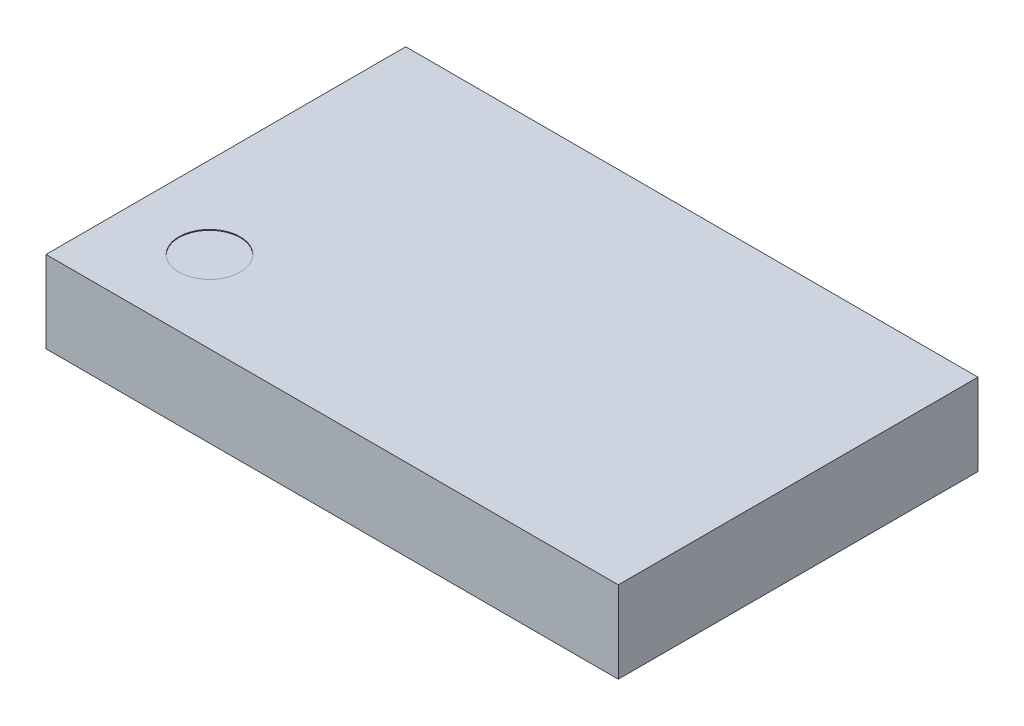
ISO-10303-21;
HEADER;
FILE_DESCRIPTION(('STEP AP214'),'2;1');
FILE_NAME('part.step','',(''),(''),'','','');
FILE_SCHEMA(('AUTOMOTIVE_DESIGN { 1 0 10303 214 1 1 1 1 }'));
ENDSEC;
DATA;
#1=APPLICATION_CONTEXT('core data for automotive mechanical design processes');
#2=APPLICATION_PROTOCOL_DEFINITION('international standard','automotive_design',2000,#1);
#3=PRODUCT_CONTEXT('',#1,'mechanical');
#4=PRODUCT('Part','Part','',(#3));
#5=PRODUCT_RELATED_PRODUCT_CATEGORY('part','',(#4));
#6=PRODUCT_DEFINITION_FORMATION('','',#4);
#7=PRODUCT_DEFINITION_CONTEXT('part definition',#1,'design');
#8=PRODUCT_DEFINITION('design','',#6,#7);
#9=PRODUCT_DEFINITION_SHAPE('','',#8);
#10=(LENGTH_UNIT() NAMED_UNIT(*) SI_UNIT(.MILLI.,.METRE.));
#11=(NAMED_UNIT(*) PLANE_ANGLE_UNIT() SI_UNIT($,.RADIAN.));
#12=(NAMED_UNIT(*) SI_UNIT($,.STERADIAN.) SOLID_ANGLE_UNIT());
#13=UNCERTAINTY_MEASURE_WITH_UNIT(LENGTH_MEASURE(1.E-05),#10,'distance_accuracy_value','');
#14=(GEOMETRIC_REPRESENTATION_CONTEXT(3) GLOBAL_UNCERTAINTY_ASSIGNED_CONTEXT((#13)) GLOBAL_UNIT_ASSIGNED_CONTEXT((#10,
#11,#12)) REPRESENTATION_CONTEXT('',''));
#15=CARTESIAN_POINT('',(0.,0.,0.));
#16=DIRECTION('',(0.,0.,1.));
#17=DIRECTION('',(1.,0.,0.));
#18=AXIS2_PLACEMENT_3D('',#15,#16,#17);
#19=CARTESIAN_POINT('',(-2.5,0.99,2.7));
#20=DIRECTION('',(0.,1.,0.));
#21=DIRECTION('',(0.,0.,1.));
#22=AXIS2_PLACEMENT_3D('',#19,#20,#21);
#23=CYLINDRICAL_SURFACE('',#22,0.375);
#24=CARTESIAN_POINT('',(-2.5,0.99,2.7));
#25=DIRECTION('',(0.,1.,0.));
#26=DIRECTION('',(0.,0.,1.));
#27=AXIS2_PLACEMENT_3D('',#24,#25,#26);
#28=CIRCLE('',#27,0.375);
#29=CARTESIAN_POINT('',(-2.5,0.99,2.325));
#30=VERTEX_POINT('',#29);
#31=CARTESIAN_POINT('',(-2.5,0.99,3.075));
#32=VERTEX_POINT('',#31);
#33=EDGE_CURVE('E10',#30,#32,#28,.T.);
#34=ORIENTED_EDGE('',*,*,#33,.F.);
#35=DIRECTION('',(0.,1.,0.));
#36=VECTOR('',#35,1.);
#37=CARTESIAN_POINT('',(-2.5,0.99,2.325));
#38=LINE('',#37,#36);
#39=CARTESIAN_POINT('',(-2.5,1.,2.325));
#40=VERTEX_POINT('',#39);
#41=EDGE_CURVE('E23',#30,#40,#38,.T.);
#42=ORIENTED_EDGE('',*,*,#41,.T.);
#43=CARTESIAN_POINT('',(-2.5,1.,2.7));
#44=DIRECTION('',(0.,1.,0.));
#45=DIRECTION('',(0.,0.,1.));
#46=AXIS2_PLACEMENT_3D('',#43,#44,#45);
#47=CIRCLE('',#46,0.375);
#48=CARTESIAN_POINT('',(-2.5,1.,3.075));
#49=VERTEX_POINT('',#48);
#50=EDGE_CURVE('E116',#40,#49,#47,.T.);
#51=ORIENTED_EDGE('',*,*,#50,.T.);
#52=DIRECTION('',(0.,1.,0.));
#53=VECTOR('',#52,1.);
#54=CARTESIAN_POINT('',(-2.5,0.99,3.075));
#55=LINE('',#54,#53);
#56=EDGE_CURVE('E36',#32,#49,#55,.T.);
#57=ORIENTED_EDGE('',*,*,#56,.F.);
#58=EDGE_LOOP('',(#34,#42,#51,#57));
#59=FACE_BOUND('',#58,.T.);
#60=ADVANCED_FACE('F16',(#59),#23,.F.);
#61=CARTESIAN_POINT('',(0.,1.,3.7));
#62=DIRECTION('',(0.,0.,-1.));
#63=DIRECTION('',(-1.,0.,0.));
#64=AXIS2_PLACEMENT_3D('',#61,#62,#63);
#65=PLANE('',#64);
#66=DIRECTION('',(1.,0.,0.));
#67=VECTOR('',#66,1.);
#68=CARTESIAN_POINT('',(0.,0.,3.7));
#69=LINE('',#68,#67);
#70=CARTESIAN_POINT('',(-3.5,0.,3.7));
#71=VERTEX_POINT('',#70);
#72=CARTESIAN_POINT('',(3.5,0.,3.7));
#73=VERTEX_POINT('',#72);
#74=EDGE_CURVE('E113',#71,#73,#69,.T.);
#75=ORIENTED_EDGE('',*,*,#74,.T.);
#76=DIRECTION('',(0.,-1.,0.));
#77=VECTOR('',#76,1.);
#78=CARTESIAN_POINT('',(3.5,1.,3.7));
#79=LINE('',#78,#77);
#80=CARTESIAN_POINT('',(3.5,1.,3.7));
#81=VERTEX_POINT('',#80);
#82=EDGE_CURVE('E110',#81,#73,#79,.T.);
#83=ORIENTED_EDGE('',*,*,#82,.F.);
#84=DIRECTION('',(1.,0.,0.));
#85=VECTOR('',#84,1.);
#86=CARTESIAN_POINT('',(0.,1.,3.7));
#87=LINE('',#86,#85);
#88=CARTESIAN_POINT('',(-3.5,1.,3.7));
#89=VERTEX_POINT('',#88);
#90=EDGE_CURVE('E108',#89,#81,#87,.T.);
#91=ORIENTED_EDGE('',*,*,#90,.F.);
#92=DIRECTION('',(0.,-1.,0.));
#93=VECTOR('',#92,1.);
#94=CARTESIAN_POINT('',(-3.5,1.,3.7));
#95=LINE('',#94,#93);
#96=EDGE_CURVE('E93',#89,#71,#95,.T.);
#97=ORIENTED_EDGE('',*,*,#96,.T.);
#98=EDGE_LOOP('',(#75,#83,#91,#97));
#99=FACE_BOUND('',#98,.T.);
#100=ADVANCED_FACE('F133',(#99),#65,.F.);
#101=CARTESIAN_POINT('',(3.5,1.,0.));
#102=DIRECTION('',(-1.,0.,0.));
#103=DIRECTION('',(0.,0.,1.));
#104=AXIS2_PLACEMENT_3D('',#101,#102,#103);
#105=PLANE('',#104);
#106=DIRECTION('',(0.,0.,-1.));
#107=VECTOR('',#106,1.);
#108=CARTESIAN_POINT('',(3.5,0.,0.));
#109=LINE('',#108,#107);
#110=CARTESIAN_POINT('',(3.5,0.,-0.7));
#111=VERTEX_POINT('',#110);
#112=EDGE_CURVE('E105',#73,#111,#109,.T.);
#113=ORIENTED_EDGE('',*,*,#112,.T.);
#114=DIRECTION('',(0.,-1.,0.));
#115=VECTOR('',#114,1.);
#116=CARTESIAN_POINT('',(3.5,1.,-0.7));
#117=LINE('',#116,#115);
#118=CARTESIAN_POINT('',(3.5,1.,-0.7));
#119=VERTEX_POINT('',#118);
#120=EDGE_CURVE('E103',#119,#111,#117,.T.);
#121=ORIENTED_EDGE('',*,*,#120,.F.);
#122=DIRECTION('',(0.,0.,-1.));
#123=VECTOR('',#122,1.);
#124=CARTESIAN_POINT('',(3.5,1.,0.));
#125=LINE('',#124,#123);
#126=EDGE_CURVE('E87',#81,#119,#125,.T.);
#127=ORIENTED_EDGE('',*,*,#126,.F.);
#128=ORIENTED_EDGE('',*,*,#82,.T.);
#129=EDGE_LOOP('',(#113,#121,#127,#128));
#130=FACE_BOUND('',#129,.T.);
#131=ADVANCED_FACE('F137',(#130),#105,.F.);
#132=CARTESIAN_POINT('',(0.,1.,-0.7));
#133=DIRECTION('',(0.,0.,-1.));
#134=DIRECTION('',(-1.,0.,0.));
#135=AXIS2_PLACEMENT_3D('',#132,#133,#134);
#136=PLANE('',#135);
#137=DIRECTION('',(1.,0.,0.));
#138=VECTOR('',#137,1.);
#139=CARTESIAN_POINT('',(0.,0.,-0.7));
#140=LINE('',#139,#138);
#141=CARTESIAN_POINT('',(-3.5,0.,-0.7));
#142=VERTEX_POINT('',#141);
#143=EDGE_CURVE('E74',#142,#111,#140,.T.);
#144=ORIENTED_EDGE('',*,*,#143,.F.);
#145=DIRECTION('',(0.,-1.,0.));
#146=VECTOR('',#145,1.);
#147=CARTESIAN_POINT('',(-3.5,1.,-0.7));
#148=LINE('',#147,#146);
#149=CARTESIAN_POINT('',(-3.5,1.,-0.7));
#150=VERTEX_POINT('',#149);
#151=EDGE_CURVE('E68',#150,#142,#148,.T.);
#152=ORIENTED_EDGE('',*,*,#151,.F.);
#153=DIRECTION('',(1.,0.,0.));
#154=VECTOR('',#153,1.);
#155=CARTESIAN_POINT('',(0.,1.,-0.7));
#156=LINE('',#155,#154);
#157=EDGE_CURVE('E72',#150,#119,#156,.T.);
#158=ORIENTED_EDGE('',*,*,#157,.T.);
#159=ORIENTED_EDGE('',*,*,#120,.T.);
#160=EDGE_LOOP('',(#144,#152,#158,#159));
#161=FACE_BOUND('',#160,.T.);
#162=ADVANCED_FACE('F70',(#161),#136,.T.);
#163=CARTESIAN_POINT('',(-3.5,1.,0.));
#164=DIRECTION('',(-1.,0.,0.));
#165=DIRECTION('',(0.,0.,1.));
#166=AXIS2_PLACEMENT_3D('',#163,#164,#165);
#167=PLANE('',#166);
#168=DIRECTION('',(0.,0.,-1.));
#169=VECTOR('',#168,1.);
#170=CARTESIAN_POINT('',(-3.5,0.,0.));
#171=LINE('',#170,#169);
#172=EDGE_CURVE('E88',#71,#142,#171,.T.);
#173=ORIENTED_EDGE('',*,*,#172,.F.);
#174=ORIENTED_EDGE('',*,*,#96,.F.);
#175=DIRECTION('',(0.,0.,-1.));
#176=VECTOR('',#175,1.);
#177=CARTESIAN_POINT('',(-3.5,1.,0.));
#178=LINE('',#177,#176);
#179=EDGE_CURVE('E85',#89,#150,#178,.T.);
#180=ORIENTED_EDGE('',*,*,#179,.T.);
#181=ORIENTED_EDGE('',*,*,#151,.T.);
#182=EDGE_LOOP('',(#173,#174,#180,#181));
#183=FACE_BOUND('',#182,.T.);
#184=ADVANCED_FACE('F91',(#183),#167,.T.);
#185=CARTESIAN_POINT('',(0.,1.,0.));
#186=DIRECTION('',(0.,1.,0.));
#187=DIRECTION('',(0.,0.,1.));
#188=AXIS2_PLACEMENT_3D('',#185,#186,#187);
#189=PLANE('',#188);
#190=CARTESIAN_POINT('',(-2.5,1.,2.7));
#191=DIRECTION('',(0.,1.,0.));
#192=DIRECTION('',(0.,0.,1.));
#193=AXIS2_PLACEMENT_3D('',#190,#191,#192);
#194=CIRCLE('',#193,0.375);
#195=EDGE_CURVE('E94',#49,#40,#194,.T.);
#196=ORIENTED_EDGE('',*,*,#195,.F.);
#197=ORIENTED_EDGE('',*,*,#50,.F.);
#198=EDGE_LOOP('',(#196,#197));
#199=FACE_BOUND('',#198,.T.);
#200=ORIENTED_EDGE('',*,*,#90,.T.);
#201=ORIENTED_EDGE('',*,*,#126,.T.);
#202=ORIENTED_EDGE('',*,*,#157,.F.);
#203=ORIENTED_EDGE('',*,*,#179,.F.);
#204=EDGE_LOOP('',(#200,#201,#202,#203));
#205=FACE_BOUND('',#204,.T.);
#206=ADVANCED_FACE('F84',(#199,#205),#189,.T.);
#207=CARTESIAN_POINT('',(0.,0.,0.));
#208=DIRECTION('',(0.,1.,0.));
#209=DIRECTION('',(0.,0.,1.));
#210=AXIS2_PLACEMENT_3D('',#207,#208,#209);
#211=PLANE('',#210);
#212=ORIENTED_EDGE('',*,*,#74,.F.);
#213=ORIENTED_EDGE('',*,*,#172,.T.);
#214=ORIENTED_EDGE('',*,*,#143,.T.);
#215=ORIENTED_EDGE('',*,*,#112,.F.);
#216=EDGE_LOOP('',(#212,#213,#214,#215));
#217=FACE_BOUND('',#216,.T.);
#218=ADVANCED_FACE('F122',(#217),#211,.F.);
#219=CARTESIAN_POINT('',(-2.5,0.99,2.7));
#220=DIRECTION('',(0.,1.,0.));
#221=DIRECTION('',(0.,0.,1.));
#222=AXIS2_PLACEMENT_3D('',#219,#220,#221);
#223=CYLINDRICAL_SURFACE('',#222,0.375);
#224=ORIENTED_EDGE('',*,*,#41,.F.);
#225=CARTESIAN_POINT('',(-2.5,0.99,2.7));
#226=DIRECTION('',(0.,1.,0.));
#227=DIRECTION('',(0.,0.,1.));
#228=AXIS2_PLACEMENT_3D('',#225,#226,#227);
#229=CIRCLE('',#228,0.375);
#230=EDGE_CURVE('E97',#32,#30,#229,.T.);
#231=ORIENTED_EDGE('',*,*,#230,.F.);
#232=ORIENTED_EDGE('',*,*,#56,.T.);
#233=ORIENTED_EDGE('',*,*,#195,.T.);
#234=EDGE_LOOP('',(#224,#231,#232,#233));
#235=FACE_BOUND('',#234,.T.);
#236=ADVANCED_FACE('F119',(#235),#223,.F.);
#237=CARTESIAN_POINT('',(-2.5,0.99,2.7));
#238=DIRECTION('',(0.,1.,0.));
#239=DIRECTION('',(0.,0.,1.));
#240=AXIS2_PLACEMENT_3D('',#237,#238,#239);
#241=PLANE('',#240);
#242=ORIENTED_EDGE('',*,*,#230,.T.);
#243=ORIENTED_EDGE('',*,*,#33,.T.);
#244=EDGE_LOOP('',(#242,#243));
#245=FACE_BOUND('',#244,.T.);
#246=ADVANCED_FACE('F182',(#245),#241,.T.);
#247=CLOSED_SHELL('',(#60,#100,#131,#162,#184,#206,#218,#236,#246));
#248=MANIFOLD_SOLID_BREP('B1',#247);
#249=ADVANCED_BREP_SHAPE_REPRESENTATION('',(#18,#248),#14);
#250=SHAPE_DEFINITION_REPRESENTATION(#9,#249);
ENDSEC;
END-ISO-10303-21;
